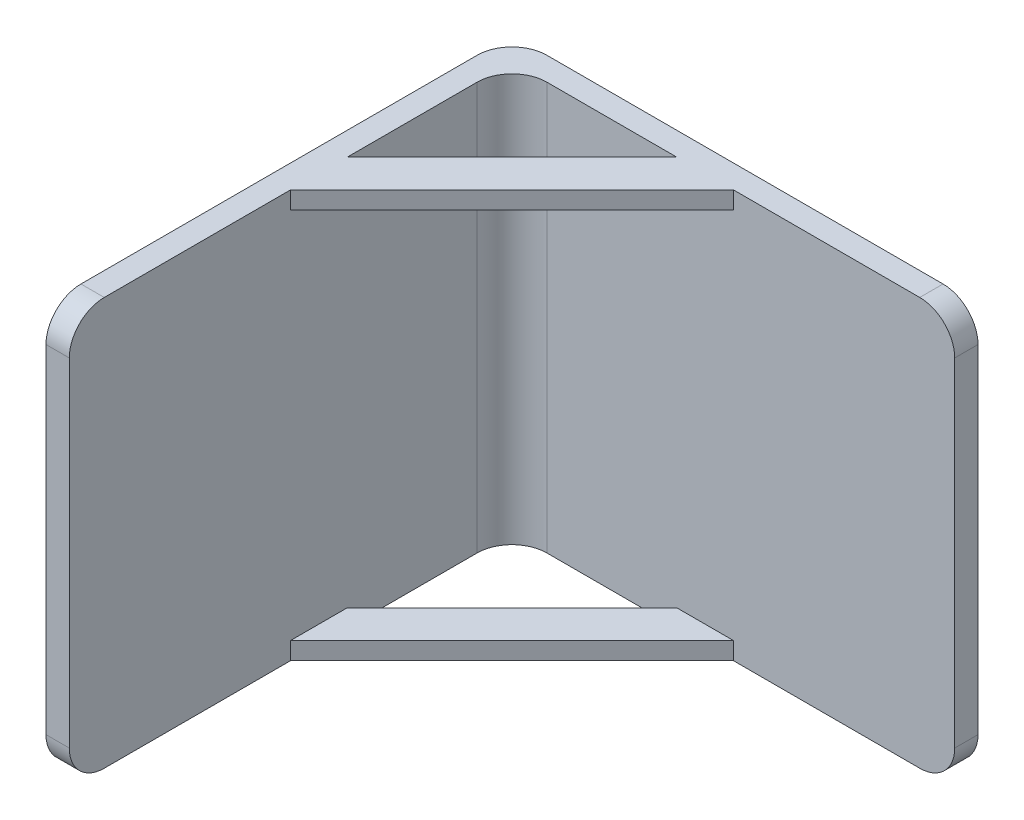
ISO-10303-21;
HEADER;
FILE_DESCRIPTION(('STEP AP214'),'2;1');
FILE_NAME('part.step','',(''),(''),'','','');
FILE_SCHEMA(('AUTOMOTIVE_DESIGN { 1 0 10303 214 1 1 1 1 }'));
ENDSEC;
DATA;
#1=APPLICATION_CONTEXT('core data for automotive mechanical design processes');
#2=APPLICATION_PROTOCOL_DEFINITION('international standard','automotive_design',2000,#1);
#3=PRODUCT_CONTEXT('',#1,'mechanical');
#4=PRODUCT('Part','Part','',(#3));
#5=PRODUCT_RELATED_PRODUCT_CATEGORY('part','',(#4));
#6=PRODUCT_DEFINITION_FORMATION('','',#4);
#7=PRODUCT_DEFINITION_CONTEXT('part definition',#1,'design');
#8=PRODUCT_DEFINITION('design','',#6,#7);
#9=PRODUCT_DEFINITION_SHAPE('','',#8);
#10=(LENGTH_UNIT() NAMED_UNIT(*) SI_UNIT(.MILLI.,.METRE.));
#11=(NAMED_UNIT(*) PLANE_ANGLE_UNIT() SI_UNIT($,.RADIAN.));
#12=(NAMED_UNIT(*) SI_UNIT($,.STERADIAN.) SOLID_ANGLE_UNIT());
#13=UNCERTAINTY_MEASURE_WITH_UNIT(LENGTH_MEASURE(1.E-05),#10,'distance_accuracy_value','');
#14=(GEOMETRIC_REPRESENTATION_CONTEXT(3) GLOBAL_UNCERTAINTY_ASSIGNED_CONTEXT((#13)) GLOBAL_UNIT_ASSIGNED_CONTEXT((#10,
#11,#12)) REPRESENTATION_CONTEXT('',''));
#15=CARTESIAN_POINT('',(0.,0.,0.));
#16=DIRECTION('',(0.,0.,1.));
#17=DIRECTION('',(1.,0.,0.));
#18=AXIS2_PLACEMENT_3D('',#15,#16,#17);
#19=CARTESIAN_POINT('',(0.,0.,2.));
#20=DIRECTION('',(0.,0.,-1.));
#21=DIRECTION('',(-1.,0.,0.));
#22=AXIS2_PLACEMENT_3D('',#19,#20,#21);
#23=PLANE('',#22);
#24=DIRECTION('',(1.,0.,0.));
#25=VECTOR('',#24,1.);
#26=CARTESIAN_POINT('',(-3.85786437626902,16.,2.));
#27=LINE('',#26,#25);
#28=CARTESIAN_POINT('',(-3.85786437626902,16.,2.));
#29=VERTEX_POINT('',#28);
#30=CARTESIAN_POINT('',(1.,16.,2.));
#31=VERTEX_POINT('',#30);
#32=EDGE_CURVE('E56',#29,#31,#27,.T.);
#33=ORIENTED_EDGE('',*,*,#32,.F.);
#34=DIRECTION('',(0.,-1.,0.));
#35=VECTOR('',#34,1.);
#36=CARTESIAN_POINT('',(-3.85786437626902,17.5,2.));
#37=LINE('',#36,#35);
#38=CARTESIAN_POINT('',(-3.85786437626902,17.5,2.));
#39=VERTEX_POINT('',#38);
#40=EDGE_CURVE('E182',#39,#29,#37,.T.);
#41=ORIENTED_EDGE('',*,*,#40,.F.);
#42=DIRECTION('',(-1.,0.,0.));
#43=VECTOR('',#42,1.);
#44=CARTESIAN_POINT('',(-20.,17.5,2.));
#45=LINE('',#44,#43);
#46=CARTESIAN_POINT('',(-15.,17.5,2.));
#47=VERTEX_POINT('',#46);
#48=EDGE_CURVE('E173',#39,#47,#45,.T.);
#49=ORIENTED_EDGE('',*,*,#48,.T.);
#50=DIRECTION('',(0.,1.,0.));
#51=VECTOR('',#50,1.);
#52=CARTESIAN_POINT('',(-15.,-17.5,2.));
#53=LINE('',#52,#51);
#54=CARTESIAN_POINT('',(-15.,-17.5,2.));
#55=VERTEX_POINT('',#54);
#56=EDGE_CURVE('E308',#47,#55,#53,.F.);
#57=ORIENTED_EDGE('',*,*,#56,.T.);
#58=DIRECTION('',(1.,0.,0.));
#59=VECTOR('',#58,1.);
#60=CARTESIAN_POINT('',(-20.,-17.5,2.));
#61=LINE('',#60,#59);
#62=CARTESIAN_POINT('',(-3.85786437626902,-17.5,2.));
#63=VERTEX_POINT('',#62);
#64=EDGE_CURVE('E255',#55,#63,#61,.T.);
#65=ORIENTED_EDGE('',*,*,#64,.T.);
#66=DIRECTION('',(0.,-1.,0.));
#67=VECTOR('',#66,1.);
#68=CARTESIAN_POINT('',(-3.85786437626902,-16.,2.));
#69=LINE('',#68,#67);
#70=CARTESIAN_POINT('',(-3.85786437626902,-16.,2.));
#71=VERTEX_POINT('',#70);
#72=EDGE_CURVE('E226',#71,#63,#69,.T.);
#73=ORIENTED_EDGE('',*,*,#72,.F.);
#74=DIRECTION('',(1.,0.,0.));
#75=VECTOR('',#74,1.);
#76=CARTESIAN_POINT('',(-3.85786437626902,-16.,2.));
#77=LINE('',#76,#75);
#78=CARTESIAN_POINT('',(1.,-16.,2.));
#79=VERTEX_POINT('',#78);
#80=EDGE_CURVE('E210',#71,#79,#77,.T.);
#81=ORIENTED_EDGE('',*,*,#80,.T.);
#82=DIRECTION('',(0.,-1.,0.));
#83=VECTOR('',#82,1.);
#84=CARTESIAN_POINT('',(1.,-16.,2.));
#85=LINE('',#84,#83);
#86=CARTESIAN_POINT('',(1.,-17.5,2.));
#87=VERTEX_POINT('',#86);
#88=EDGE_CURVE('E221',#79,#87,#85,.T.);
#89=ORIENTED_EDGE('',*,*,#88,.T.);
#90=CARTESIAN_POINT('',(17.,-17.5,2.));
#91=VERTEX_POINT('',#90);
#92=EDGE_CURVE('E254',#87,#91,#61,.T.);
#93=ORIENTED_EDGE('',*,*,#92,.T.);
#94=CARTESIAN_POINT('',(17.,-14.5,2.));
#95=DIRECTION('',(0.,0.,-1.));
#96=DIRECTION('',(-1.,0.,0.));
#97=AXIS2_PLACEMENT_3D('',#94,#95,#96);
#98=CIRCLE('',#97,3.);
#99=CARTESIAN_POINT('',(20.,-14.5,2.));
#100=VERTEX_POINT('',#99);
#101=EDGE_CURVE('E304',#91,#100,#98,.F.);
#102=ORIENTED_EDGE('',*,*,#101,.T.);
#103=DIRECTION('',(0.,1.,0.));
#104=VECTOR('',#103,1.);
#105=CARTESIAN_POINT('',(20.,-17.5,2.));
#106=LINE('',#105,#104);
#107=CARTESIAN_POINT('',(20.,14.5,2.));
#108=VERTEX_POINT('',#107);
#109=EDGE_CURVE('E180',#100,#108,#106,.T.);
#110=ORIENTED_EDGE('',*,*,#109,.T.);
#111=CARTESIAN_POINT('',(17.,14.5,2.));
#112=DIRECTION('',(0.,0.,-1.));
#113=DIRECTION('',(-1.,0.,0.));
#114=AXIS2_PLACEMENT_3D('',#111,#112,#113);
#115=CIRCLE('',#114,3.);
#116=CARTESIAN_POINT('',(17.,17.5,2.));
#117=VERTEX_POINT('',#116);
#118=EDGE_CURVE('E306',#108,#117,#115,.F.);
#119=ORIENTED_EDGE('',*,*,#118,.T.);
#120=CARTESIAN_POINT('',(1.,17.5,2.));
#121=VERTEX_POINT('',#120);
#122=EDGE_CURVE('E179',#117,#121,#45,.T.);
#123=ORIENTED_EDGE('',*,*,#122,.T.);
#124=DIRECTION('',(0.,-1.,0.));
#125=VECTOR('',#124,1.);
#126=CARTESIAN_POINT('',(1.,17.5,2.));
#127=LINE('',#126,#125);
#128=EDGE_CURVE('E51',#121,#31,#127,.T.);
#129=ORIENTED_EDGE('',*,*,#128,.T.);
#130=EDGE_LOOP('',(#33,#41,#49,#57,#65,#73,#81,#89,#93,#102,#110,#119,#123,#129));
#131=FACE_BOUND('',#130,.T.);
#132=ADVANCED_FACE('F36',(#131),#23,.F.);
#133=CARTESIAN_POINT('',(20.,-17.5,2.));
#134=DIRECTION('',(-1.,0.,0.));
#135=DIRECTION('',(0.,0.,1.));
#136=AXIS2_PLACEMENT_3D('',#133,#134,#135);
#137=PLANE('',#136);
#138=DIRECTION('',(0.,1.,0.));
#139=VECTOR('',#138,1.);
#140=CARTESIAN_POINT('',(20.,-17.5,0.));
#141=LINE('',#140,#139);
#142=CARTESIAN_POINT('',(20.,-14.5,0.));
#143=VERTEX_POINT('',#142);
#144=CARTESIAN_POINT('',(20.,14.5,0.));
#145=VERTEX_POINT('',#144);
#146=EDGE_CURVE('E250',#143,#145,#141,.T.);
#147=ORIENTED_EDGE('',*,*,#146,.T.);
#148=DIRECTION('',(0.,0.,-1.));
#149=VECTOR('',#148,1.);
#150=CARTESIAN_POINT('',(20.,14.5,2.));
#151=LINE('',#150,#149);
#152=EDGE_CURVE('E313',#145,#108,#151,.F.);
#153=ORIENTED_EDGE('',*,*,#152,.T.);
#154=ORIENTED_EDGE('',*,*,#109,.F.);
#155=DIRECTION('',(0.,0.,-1.));
#156=VECTOR('',#155,1.);
#157=CARTESIAN_POINT('',(20.,-14.5,2.));
#158=LINE('',#157,#156);
#159=EDGE_CURVE('E310',#100,#143,#158,.T.);
#160=ORIENTED_EDGE('',*,*,#159,.T.);
#161=EDGE_LOOP('',(#147,#153,#154,#160));
#162=FACE_BOUND('',#161,.T.);
#163=ADVANCED_FACE('F363',(#162),#137,.F.);
#164=CARTESIAN_POINT('',(-20.,17.5,2.));
#165=DIRECTION('',(0.,-1.,0.));
#166=DIRECTION('',(0.,0.,-1.));
#167=AXIS2_PLACEMENT_3D('',#164,#165,#166);
#168=PLANE('',#167);
#169=DIRECTION('',(-0.707106781186548,0.,0.707106781186548));
#170=VECTOR('',#169,1.);
#171=CARTESIAN_POINT('',(1.,17.5,2.));
#172=LINE('',#171,#170);
#173=CARTESIAN_POINT('',(-18.,17.5,21.));
#174=VERTEX_POINT('',#173);
#175=EDGE_CURVE('E191',#121,#174,#172,.T.);
#176=ORIENTED_EDGE('',*,*,#175,.F.);
#177=ORIENTED_EDGE('',*,*,#122,.F.);
#178=DIRECTION('',(0.,0.,-1.));
#179=VECTOR('',#178,1.);
#180=CARTESIAN_POINT('',(17.,17.5,2.));
#181=LINE('',#180,#179);
#182=CARTESIAN_POINT('',(17.,17.5,0.));
#183=VERTEX_POINT('',#182);
#184=EDGE_CURVE('E292',#117,#183,#181,.T.);
#185=ORIENTED_EDGE('',*,*,#184,.T.);
#186=DIRECTION('',(-1.,0.,0.));
#187=VECTOR('',#186,1.);
#188=CARTESIAN_POINT('',(-20.,17.5,0.));
#189=LINE('',#188,#187);
#190=CARTESIAN_POINT('',(-17.,17.5,0.));
#191=VERTEX_POINT('',#190);
#192=EDGE_CURVE('E260',#183,#191,#189,.T.);
#193=ORIENTED_EDGE('',*,*,#192,.T.);
#194=CARTESIAN_POINT('',(-17.,17.5,3.));
#195=DIRECTION('',(0.,-1.,0.));
#196=DIRECTION('',(0.,0.,-1.));
#197=AXIS2_PLACEMENT_3D('',#194,#195,#196);
#198=CIRCLE('',#197,3.);
#199=CARTESIAN_POINT('',(-20.,17.5,3.));
#200=VERTEX_POINT('',#199);
#201=EDGE_CURVE('E295',#191,#200,#198,.F.);
#202=ORIENTED_EDGE('',*,*,#201,.T.);
#203=DIRECTION('',(0.,0.,-1.));
#204=VECTOR('',#203,1.);
#205=CARTESIAN_POINT('',(-20.,17.5,2.));
#206=LINE('',#205,#204);
#207=CARTESIAN_POINT('',(-20.,17.5,37.));
#208=VERTEX_POINT('',#207);
#209=EDGE_CURVE('E267',#208,#200,#206,.T.);
#210=ORIENTED_EDGE('',*,*,#209,.F.);
#211=DIRECTION('',(-1.,0.,0.));
#212=VECTOR('',#211,1.);
#213=CARTESIAN_POINT('',(-20.,17.5,37.));
#214=LINE('',#213,#212);
#215=CARTESIAN_POINT('',(-18.,17.5,37.));
#216=VERTEX_POINT('',#215);
#217=EDGE_CURVE('E290',#208,#216,#214,.F.);
#218=ORIENTED_EDGE('',*,*,#217,.T.);
#219=DIRECTION('',(0.,0.,-1.));
#220=VECTOR('',#219,1.);
#221=CARTESIAN_POINT('',(-18.,17.5,40.));
#222=LINE('',#221,#220);
#223=EDGE_CURVE('E244',#216,#174,#222,.T.);
#224=ORIENTED_EDGE('',*,*,#223,.T.);
#225=EDGE_LOOP('',(#176,#177,#185,#193,#202,#210,#218,#224));
#226=FACE_BOUND('',#225,.T.);
#227=ORIENTED_EDGE('',*,*,#48,.F.);
#228=DIRECTION('',(0.707106781186549,0.,-0.707106781186546));
#229=VECTOR('',#228,1.);
#230=CARTESIAN_POINT('',(-18.,17.5,16.1421356237309));
#231=LINE('',#230,#229);
#232=CARTESIAN_POINT('',(-18.,17.5,16.1421356237309));
#233=VERTEX_POINT('',#232);
#234=EDGE_CURVE('E176',#233,#39,#231,.T.);
#235=ORIENTED_EDGE('',*,*,#234,.F.);
#236=CARTESIAN_POINT('',(-18.,17.5,5.));
#237=VERTEX_POINT('',#236);
#238=EDGE_CURVE('E243',#233,#237,#222,.T.);
#239=ORIENTED_EDGE('',*,*,#238,.T.);
#240=CARTESIAN_POINT('',(-15.,17.5,5.));
#241=DIRECTION('',(0.,-1.,0.));
#242=DIRECTION('',(0.,0.,-1.));
#243=AXIS2_PLACEMENT_3D('',#240,#241,#242);
#244=CIRCLE('',#243,3.);
#245=EDGE_CURVE('E44',#237,#47,#244,.T.);
#246=ORIENTED_EDGE('',*,*,#245,.T.);
#247=EDGE_LOOP('',(#227,#235,#239,#246));
#248=FACE_BOUND('',#247,.T.);
#249=ADVANCED_FACE('F174',(#226,#248),#168,.F.);
#250=CARTESIAN_POINT('',(-20.,-17.5,2.));
#251=DIRECTION('',(1.,0.,0.));
#252=DIRECTION('',(0.,0.,-1.));
#253=AXIS2_PLACEMENT_3D('',#250,#251,#252);
#254=PLANE('',#253);
#255=ORIENTED_EDGE('',*,*,#209,.T.);
#256=DIRECTION('',(0.,-1.,0.));
#257=VECTOR('',#256,1.);
#258=CARTESIAN_POINT('',(-20.,-17.5,3.));
#259=LINE('',#258,#257);
#260=CARTESIAN_POINT('',(-20.,-17.5,3.));
#261=VERTEX_POINT('',#260);
#262=EDGE_CURVE('E274',#200,#261,#259,.T.);
#263=ORIENTED_EDGE('',*,*,#262,.T.);
#264=DIRECTION('',(0.,0.,-1.));
#265=VECTOR('',#264,1.);
#266=CARTESIAN_POINT('',(-20.,-17.5,2.));
#267=LINE('',#266,#265);
#268=CARTESIAN_POINT('',(-20.,-17.5,37.));
#269=VERTEX_POINT('',#268);
#270=EDGE_CURVE('E257',#269,#261,#267,.T.);
#271=ORIENTED_EDGE('',*,*,#270,.F.);
#272=CARTESIAN_POINT('',(-20.,-14.5,37.));
#273=DIRECTION('',(1.,0.,0.));
#274=DIRECTION('',(0.,0.,-1.));
#275=AXIS2_PLACEMENT_3D('',#272,#273,#274);
#276=CIRCLE('',#275,3.);
#277=CARTESIAN_POINT('',(-20.,-14.5,40.));
#278=VERTEX_POINT('',#277);
#279=EDGE_CURVE('E270',#269,#278,#276,.F.);
#280=ORIENTED_EDGE('',*,*,#279,.T.);
#281=DIRECTION('',(0.,-1.,0.));
#282=VECTOR('',#281,1.);
#283=CARTESIAN_POINT('',(-20.,17.5,40.));
#284=LINE('',#283,#282);
#285=CARTESIAN_POINT('',(-20.,14.5,40.));
#286=VERTEX_POINT('',#285);
#287=EDGE_CURVE('E229',#286,#278,#284,.T.);
#288=ORIENTED_EDGE('',*,*,#287,.F.);
#289=CARTESIAN_POINT('',(-20.,14.5,37.));
#290=DIRECTION('',(1.,0.,0.));
#291=DIRECTION('',(0.,0.,-1.));
#292=AXIS2_PLACEMENT_3D('',#289,#290,#291);
#293=CIRCLE('',#292,3.);
#294=EDGE_CURVE('E272',#286,#208,#293,.F.);
#295=ORIENTED_EDGE('',*,*,#294,.T.);
#296=EDGE_LOOP('',(#255,#263,#271,#280,#288,#295));
#297=FACE_BOUND('',#296,.T.);
#298=ADVANCED_FACE('F329',(#297),#254,.F.);
#299=CARTESIAN_POINT('',(-20.,-17.5,2.));
#300=DIRECTION('',(0.,1.,0.));
#301=DIRECTION('',(0.,0.,1.));
#302=AXIS2_PLACEMENT_3D('',#299,#300,#301);
#303=PLANE('',#302);
#304=ORIENTED_EDGE('',*,*,#92,.F.);
#305=DIRECTION('',(-0.707106781186548,0.,0.707106781186548));
#306=VECTOR('',#305,1.);
#307=CARTESIAN_POINT('',(1.,-17.5,2.));
#308=LINE('',#307,#306);
#309=CARTESIAN_POINT('',(-18.,-17.5,21.));
#310=VERTEX_POINT('',#309);
#311=EDGE_CURVE('E186',#87,#310,#308,.T.);
#312=ORIENTED_EDGE('',*,*,#311,.T.);
#313=DIRECTION('',(0.,0.,-1.));
#314=VECTOR('',#313,1.);
#315=CARTESIAN_POINT('',(-18.,-17.5,40.));
#316=LINE('',#315,#314);
#317=CARTESIAN_POINT('',(-18.,-17.5,37.));
#318=VERTEX_POINT('',#317);
#319=EDGE_CURVE('E248',#318,#310,#316,.T.);
#320=ORIENTED_EDGE('',*,*,#319,.F.);
#321=DIRECTION('',(1.,0.,0.));
#322=VECTOR('',#321,1.);
#323=CARTESIAN_POINT('',(-20.,-17.5,37.));
#324=LINE('',#323,#322);
#325=EDGE_CURVE('E277',#318,#269,#324,.F.);
#326=ORIENTED_EDGE('',*,*,#325,.T.);
#327=ORIENTED_EDGE('',*,*,#270,.T.);
#328=CARTESIAN_POINT('',(-17.,-17.5,3.));
#329=DIRECTION('',(0.,1.,0.));
#330=DIRECTION('',(0.,0.,1.));
#331=AXIS2_PLACEMENT_3D('',#328,#329,#330);
#332=CIRCLE('',#331,3.);
#333=CARTESIAN_POINT('',(-17.,-17.5,0.));
#334=VERTEX_POINT('',#333);
#335=EDGE_CURVE('E282',#261,#334,#332,.F.);
#336=ORIENTED_EDGE('',*,*,#335,.T.);
#337=DIRECTION('',(1.,0.,0.));
#338=VECTOR('',#337,1.);
#339=CARTESIAN_POINT('',(-20.,-17.5,0.));
#340=LINE('',#339,#338);
#341=CARTESIAN_POINT('',(17.,-17.5,0.));
#342=VERTEX_POINT('',#341);
#343=EDGE_CURVE('E252',#334,#342,#340,.T.);
#344=ORIENTED_EDGE('',*,*,#343,.T.);
#345=DIRECTION('',(0.,0.,-1.));
#346=VECTOR('',#345,1.);
#347=CARTESIAN_POINT('',(17.,-17.5,2.));
#348=LINE('',#347,#346);
#349=EDGE_CURVE('E279',#342,#91,#348,.F.);
#350=ORIENTED_EDGE('',*,*,#349,.T.);
#351=EDGE_LOOP('',(#304,#312,#320,#326,#327,#336,#344,#350));
#352=FACE_BOUND('',#351,.T.);
#353=DIRECTION('',(0.707106781186549,0.,-0.707106781186546));
#354=VECTOR('',#353,1.);
#355=CARTESIAN_POINT('',(-18.,-17.5,16.1421356237309));
#356=LINE('',#355,#354);
#357=CARTESIAN_POINT('',(-18.,-17.5,16.1421356237309));
#358=VERTEX_POINT('',#357);
#359=EDGE_CURVE('E213',#358,#63,#356,.T.);
#360=ORIENTED_EDGE('',*,*,#359,.T.);
#361=ORIENTED_EDGE('',*,*,#64,.F.);
#362=CARTESIAN_POINT('',(-15.,-17.5,5.));
#363=DIRECTION('',(0.,1.,0.));
#364=DIRECTION('',(0.,0.,1.));
#365=AXIS2_PLACEMENT_3D('',#362,#363,#364);
#366=CIRCLE('',#365,3.);
#367=CARTESIAN_POINT('',(-18.,-17.5,5.));
#368=VERTEX_POINT('',#367);
#369=EDGE_CURVE('E11',#55,#368,#366,.T.);
#370=ORIENTED_EDGE('',*,*,#369,.T.);
#371=EDGE_CURVE('E247',#358,#368,#316,.T.);
#372=ORIENTED_EDGE('',*,*,#371,.F.);
#373=EDGE_LOOP('',(#360,#361,#370,#372));
#374=FACE_BOUND('',#373,.T.);
#375=ADVANCED_FACE('F350',(#352,#374),#303,.F.);
#376=CARTESIAN_POINT('',(0.,0.,0.));
#377=DIRECTION('',(0.,0.,-1.));
#378=DIRECTION('',(-1.,0.,0.));
#379=AXIS2_PLACEMENT_3D('',#376,#377,#378);
#380=PLANE('',#379);
#381=ORIENTED_EDGE('',*,*,#343,.F.);
#382=DIRECTION('',(0.,-1.,0.));
#383=VECTOR('',#382,1.);
#384=CARTESIAN_POINT('',(-17.,17.5,0.));
#385=LINE('',#384,#383);
#386=EDGE_CURVE('E288',#334,#191,#385,.F.);
#387=ORIENTED_EDGE('',*,*,#386,.T.);
#388=ORIENTED_EDGE('',*,*,#192,.F.);
#389=CARTESIAN_POINT('',(17.,14.5,0.));
#390=DIRECTION('',(0.,0.,-1.));
#391=DIRECTION('',(-1.,0.,0.));
#392=AXIS2_PLACEMENT_3D('',#389,#390,#391);
#393=CIRCLE('',#392,3.);
#394=EDGE_CURVE('E286',#183,#145,#393,.T.);
#395=ORIENTED_EDGE('',*,*,#394,.T.);
#396=ORIENTED_EDGE('',*,*,#146,.F.);
#397=CARTESIAN_POINT('',(17.,-14.5,0.));
#398=DIRECTION('',(0.,0.,-1.));
#399=DIRECTION('',(-1.,0.,0.));
#400=AXIS2_PLACEMENT_3D('',#397,#398,#399);
#401=CIRCLE('',#400,3.);
#402=EDGE_CURVE('E284',#143,#342,#401,.T.);
#403=ORIENTED_EDGE('',*,*,#402,.T.);
#404=EDGE_LOOP('',(#381,#387,#388,#395,#396,#403));
#405=FACE_BOUND('',#404,.T.);
#406=ADVANCED_FACE('F354',(#405),#380,.T.);
#407=CARTESIAN_POINT('',(-18.,17.5,40.));
#408=DIRECTION('',(-1.,0.,0.));
#409=DIRECTION('',(0.,-1.,0.));
#410=AXIS2_PLACEMENT_3D('',#407,#408,#409);
#411=PLANE('',#410);
#412=ORIENTED_EDGE('',*,*,#238,.F.);
#413=DIRECTION('',(0.,-1.,0.));
#414=VECTOR('',#413,1.);
#415=CARTESIAN_POINT('',(-18.,17.5,16.1421356237309));
#416=LINE('',#415,#414);
#417=CARTESIAN_POINT('',(-18.,16.,16.1421356237309));
#418=VERTEX_POINT('',#417);
#419=EDGE_CURVE('E187',#233,#418,#416,.T.);
#420=ORIENTED_EDGE('',*,*,#419,.T.);
#421=DIRECTION('',(0.,0.,-1.));
#422=VECTOR('',#421,1.);
#423=CARTESIAN_POINT('',(-18.,16.,21.));
#424=LINE('',#423,#422);
#425=CARTESIAN_POINT('',(-18.,16.,21.));
#426=VERTEX_POINT('',#425);
#427=EDGE_CURVE('E203',#426,#418,#424,.T.);
#428=ORIENTED_EDGE('',*,*,#427,.F.);
#429=DIRECTION('',(0.,-1.,0.));
#430=VECTOR('',#429,1.);
#431=CARTESIAN_POINT('',(-18.,17.5,21.));
#432=LINE('',#431,#430);
#433=EDGE_CURVE('E193',#174,#426,#432,.T.);
#434=ORIENTED_EDGE('',*,*,#433,.F.);
#435=ORIENTED_EDGE('',*,*,#223,.F.);
#436=CARTESIAN_POINT('',(-18.,14.5,37.));
#437=DIRECTION('',(-1.,0.,0.));
#438=DIRECTION('',(0.,-1.,0.));
#439=AXIS2_PLACEMENT_3D('',#436,#437,#438);
#440=CIRCLE('',#439,3.);
#441=CARTESIAN_POINT('',(-18.,14.5,40.));
#442=VERTEX_POINT('',#441);
#443=EDGE_CURVE('E299',#216,#442,#440,.F.);
#444=ORIENTED_EDGE('',*,*,#443,.T.);
#445=DIRECTION('',(0.,1.,0.));
#446=VECTOR('',#445,1.);
#447=CARTESIAN_POINT('',(-18.,17.5,40.));
#448=LINE('',#447,#446);
#449=CARTESIAN_POINT('',(-18.,-14.5,40.));
#450=VERTEX_POINT('',#449);
#451=EDGE_CURVE('E240',#450,#442,#448,.T.);
#452=ORIENTED_EDGE('',*,*,#451,.F.);
#453=CARTESIAN_POINT('',(-18.,-14.5,37.));
#454=DIRECTION('',(-1.,0.,0.));
#455=DIRECTION('',(0.,-1.,0.));
#456=AXIS2_PLACEMENT_3D('',#453,#454,#455);
#457=CIRCLE('',#456,3.);
#458=EDGE_CURVE('E297',#450,#318,#457,.F.);
#459=ORIENTED_EDGE('',*,*,#458,.T.);
#460=ORIENTED_EDGE('',*,*,#319,.T.);
#461=DIRECTION('',(0.,-1.,0.));
#462=VECTOR('',#461,1.);
#463=CARTESIAN_POINT('',(-18.,-16.,21.));
#464=LINE('',#463,#462);
#465=CARTESIAN_POINT('',(-18.,-16.,21.));
#466=VERTEX_POINT('',#465);
#467=EDGE_CURVE('E233',#466,#310,#464,.T.);
#468=ORIENTED_EDGE('',*,*,#467,.F.);
#469=DIRECTION('',(0.,0.,-1.));
#470=VECTOR('',#469,1.);
#471=CARTESIAN_POINT('',(-18.,-16.,21.));
#472=LINE('',#471,#470);
#473=CARTESIAN_POINT('',(-18.,-16.,16.1421356237309));
#474=VERTEX_POINT('',#473);
#475=EDGE_CURVE('E216',#466,#474,#472,.T.);
#476=ORIENTED_EDGE('',*,*,#475,.T.);
#477=DIRECTION('',(0.,-1.,0.));
#478=VECTOR('',#477,1.);
#479=CARTESIAN_POINT('',(-18.,-16.,16.1421356237309));
#480=LINE('',#479,#478);
#481=EDGE_CURVE('E230',#474,#358,#480,.T.);
#482=ORIENTED_EDGE('',*,*,#481,.T.);
#483=ORIENTED_EDGE('',*,*,#371,.T.);
#484=DIRECTION('',(0.,1.,0.));
#485=VECTOR('',#484,1.);
#486=CARTESIAN_POINT('',(-18.,17.5,5.));
#487=LINE('',#486,#485);
#488=EDGE_CURVE('E301',#368,#237,#487,.T.);
#489=ORIENTED_EDGE('',*,*,#488,.T.);
#490=EDGE_LOOP('',(#412,#420,#428,#434,#435,#444,#452,#459,#460,#468,#476,#482,#483,#489));
#491=FACE_BOUND('',#490,.T.);
#492=ADVANCED_FACE('F336',(#491),#411,.F.);
#493=CARTESIAN_POINT('',(0.,0.,40.));
#494=DIRECTION('',(0.,0.,-1.));
#495=DIRECTION('',(-1.,0.,0.));
#496=AXIS2_PLACEMENT_3D('',#493,#494,#495);
#497=PLANE('',#496);
#498=ORIENTED_EDGE('',*,*,#451,.T.);
#499=DIRECTION('',(-1.,0.,0.));
#500=VECTOR('',#499,1.);
#501=CARTESIAN_POINT('',(0.,14.5,40.));
#502=LINE('',#501,#500);
#503=EDGE_CURVE('E318',#442,#286,#502,.T.);
#504=ORIENTED_EDGE('',*,*,#503,.T.);
#505=ORIENTED_EDGE('',*,*,#287,.T.);
#506=DIRECTION('',(1.,0.,0.));
#507=VECTOR('',#506,1.);
#508=CARTESIAN_POINT('',(0.,-14.5,40.));
#509=LINE('',#508,#507);
#510=EDGE_CURVE('E315',#278,#450,#509,.T.);
#511=ORIENTED_EDGE('',*,*,#510,.T.);
#512=EDGE_LOOP('',(#498,#504,#505,#511));
#513=FACE_BOUND('',#512,.T.);
#514=ADVANCED_FACE('F323',(#513),#497,.F.);
#515=CARTESIAN_POINT('',(-17.,-17.5,3.));
#516=DIRECTION('',(0.,1.,0.));
#517=DIRECTION('',(0.,0.,1.));
#518=AXIS2_PLACEMENT_3D('',#515,#516,#517);
#519=CYLINDRICAL_SURFACE('',#518,3.);
#520=ORIENTED_EDGE('',*,*,#201,.F.);
#521=ORIENTED_EDGE('',*,*,#386,.F.);
#522=ORIENTED_EDGE('',*,*,#335,.F.);
#523=ORIENTED_EDGE('',*,*,#262,.F.);
#524=EDGE_LOOP('',(#520,#521,#522,#523));
#525=FACE_BOUND('',#524,.T.);
#526=ADVANCED_FACE('F346',(#525),#519,.T.);
#527=CARTESIAN_POINT('',(-15.,17.5,5.));
#528=DIRECTION('',(0.,-1.,0.));
#529=DIRECTION('',(1.,0.,0.));
#530=AXIS2_PLACEMENT_3D('',#527,#528,#529);
#531=CYLINDRICAL_SURFACE('',#530,3.);
#532=ORIENTED_EDGE('',*,*,#369,.F.);
#533=ORIENTED_EDGE('',*,*,#56,.F.);
#534=ORIENTED_EDGE('',*,*,#245,.F.);
#535=ORIENTED_EDGE('',*,*,#488,.F.);
#536=EDGE_LOOP('',(#532,#533,#534,#535));
#537=FACE_BOUND('',#536,.T.);
#538=ADVANCED_FACE('F377',(#537),#531,.F.);
#539=CARTESIAN_POINT('',(17.,14.5,2.));
#540=DIRECTION('',(0.,0.,-1.));
#541=DIRECTION('',(-1.,0.,0.));
#542=AXIS2_PLACEMENT_3D('',#539,#540,#541);
#543=CYLINDRICAL_SURFACE('',#542,3.);
#544=ORIENTED_EDGE('',*,*,#118,.F.);
#545=ORIENTED_EDGE('',*,*,#152,.F.);
#546=ORIENTED_EDGE('',*,*,#394,.F.);
#547=ORIENTED_EDGE('',*,*,#184,.F.);
#548=EDGE_LOOP('',(#544,#545,#546,#547));
#549=FACE_BOUND('',#548,.T.);
#550=ADVANCED_FACE('F369',(#549),#543,.T.);
#551=CARTESIAN_POINT('',(17.,-14.5,2.));
#552=DIRECTION('',(0.,0.,-1.));
#553=DIRECTION('',(-1.,0.,0.));
#554=AXIS2_PLACEMENT_3D('',#551,#552,#553);
#555=CYLINDRICAL_SURFACE('',#554,3.);
#556=ORIENTED_EDGE('',*,*,#101,.F.);
#557=ORIENTED_EDGE('',*,*,#349,.F.);
#558=ORIENTED_EDGE('',*,*,#402,.F.);
#559=ORIENTED_EDGE('',*,*,#159,.F.);
#560=EDGE_LOOP('',(#556,#557,#558,#559));
#561=FACE_BOUND('',#560,.T.);
#562=ADVANCED_FACE('F360',(#561),#555,.T.);
#563=CARTESIAN_POINT('',(0.,14.5,37.));
#564=DIRECTION('',(-1.,0.,0.));
#565=DIRECTION('',(0.,0.,1.));
#566=AXIS2_PLACEMENT_3D('',#563,#564,#565);
#567=CYLINDRICAL_SURFACE('',#566,3.);
#568=ORIENTED_EDGE('',*,*,#443,.F.);
#569=ORIENTED_EDGE('',*,*,#217,.F.);
#570=ORIENTED_EDGE('',*,*,#294,.F.);
#571=ORIENTED_EDGE('',*,*,#503,.F.);
#572=EDGE_LOOP('',(#568,#569,#570,#571));
#573=FACE_BOUND('',#572,.T.);
#574=ADVANCED_FACE('F340',(#573),#567,.T.);
#575=CARTESIAN_POINT('',(0.,-14.5,37.));
#576=DIRECTION('',(1.,0.,0.));
#577=DIRECTION('',(0.,0.,-1.));
#578=AXIS2_PLACEMENT_3D('',#575,#576,#577);
#579=CYLINDRICAL_SURFACE('',#578,3.);
#580=ORIENTED_EDGE('',*,*,#279,.F.);
#581=ORIENTED_EDGE('',*,*,#325,.F.);
#582=ORIENTED_EDGE('',*,*,#458,.F.);
#583=ORIENTED_EDGE('',*,*,#510,.F.);
#584=EDGE_LOOP('',(#580,#581,#582,#583));
#585=FACE_BOUND('',#584,.T.);
#586=ADVANCED_FACE('F38',(#585),#579,.T.);
#587=CARTESIAN_POINT('',(-18.,-16.,16.1421356237309));
#588=DIRECTION('',(-0.707106781186546,0.,-0.707106781186549));
#589=DIRECTION('',(-0.707106781186549,0.,0.707106781186546));
#590=AXIS2_PLACEMENT_3D('',#587,#588,#589);
#591=PLANE('',#590);
#592=ORIENTED_EDGE('',*,*,#359,.F.);
#593=ORIENTED_EDGE('',*,*,#481,.F.);
#594=DIRECTION('',(0.707106781186549,0.,-0.707106781186546));
#595=VECTOR('',#594,1.);
#596=CARTESIAN_POINT('',(-18.,-16.,16.1421356237309));
#597=LINE('',#596,#595);
#598=EDGE_CURVE('E218',#474,#71,#597,.T.);
#599=ORIENTED_EDGE('',*,*,#598,.T.);
#600=ORIENTED_EDGE('',*,*,#72,.T.);
#601=EDGE_LOOP('',(#592,#593,#599,#600));
#602=FACE_BOUND('',#601,.T.);
#603=ADVANCED_FACE('F382',(#602),#591,.T.);
#604=CARTESIAN_POINT('',(1.,-16.,2.));
#605=DIRECTION('',(0.707106781186547,0.,0.707106781186548));
#606=DIRECTION('',(0.707106781186548,0.,-0.707106781186547));
#607=AXIS2_PLACEMENT_3D('',#604,#605,#606);
#608=PLANE('',#607);
#609=ORIENTED_EDGE('',*,*,#311,.F.);
#610=ORIENTED_EDGE('',*,*,#88,.F.);
#611=DIRECTION('',(-0.707106781186548,0.,0.707106781186548));
#612=VECTOR('',#611,1.);
#613=CARTESIAN_POINT('',(1.,-16.,2.));
#614=LINE('',#613,#612);
#615=EDGE_CURVE('E212',#79,#466,#614,.T.);
#616=ORIENTED_EDGE('',*,*,#615,.T.);
#617=ORIENTED_EDGE('',*,*,#467,.T.);
#618=EDGE_LOOP('',(#609,#610,#616,#617));
#619=FACE_BOUND('',#618,.T.);
#620=ADVANCED_FACE('F392',(#619),#608,.T.);
#621=CARTESIAN_POINT('',(0.,-16.,0.));
#622=DIRECTION('',(0.,1.,0.));
#623=DIRECTION('',(0.,0.,1.));
#624=AXIS2_PLACEMENT_3D('',#621,#622,#623);
#625=PLANE('',#624);
#626=ORIENTED_EDGE('',*,*,#80,.F.);
#627=ORIENTED_EDGE('',*,*,#598,.F.);
#628=ORIENTED_EDGE('',*,*,#475,.F.);
#629=ORIENTED_EDGE('',*,*,#615,.F.);
#630=EDGE_LOOP('',(#626,#627,#628,#629));
#631=FACE_BOUND('',#630,.T.);
#632=ADVANCED_FACE('F388',(#631),#625,.T.);
#633=CARTESIAN_POINT('',(-18.,17.5,16.1421356237309));
#634=DIRECTION('',(-0.707106781186546,0.,-0.707106781186549));
#635=DIRECTION('',(-0.707106781186549,0.,0.707106781186546));
#636=AXIS2_PLACEMENT_3D('',#633,#634,#635);
#637=PLANE('',#636);
#638=DIRECTION('',(0.707106781186549,0.,-0.707106781186546));
#639=VECTOR('',#638,1.);
#640=CARTESIAN_POINT('',(-18.,16.,16.1421356237309));
#641=LINE('',#640,#639);
#642=EDGE_CURVE('E196',#418,#29,#641,.T.);
#643=ORIENTED_EDGE('',*,*,#642,.F.);
#644=ORIENTED_EDGE('',*,*,#419,.F.);
#645=ORIENTED_EDGE('',*,*,#234,.T.);
#646=ORIENTED_EDGE('',*,*,#40,.T.);
#647=EDGE_LOOP('',(#643,#644,#645,#646));
#648=FACE_BOUND('',#647,.T.);
#649=ADVANCED_FACE('F190',(#648),#637,.T.);
#650=CARTESIAN_POINT('',(1.,17.5,2.));
#651=DIRECTION('',(0.707106781186547,0.,0.707106781186548));
#652=DIRECTION('',(0.707106781186548,0.,-0.707106781186547));
#653=AXIS2_PLACEMENT_3D('',#650,#651,#652);
#654=PLANE('',#653);
#655=DIRECTION('',(-0.707106781186548,0.,0.707106781186548));
#656=VECTOR('',#655,1.);
#657=CARTESIAN_POINT('',(1.,16.,2.));
#658=LINE('',#657,#656);
#659=EDGE_CURVE('E200',#31,#426,#658,.T.);
#660=ORIENTED_EDGE('',*,*,#659,.F.);
#661=ORIENTED_EDGE('',*,*,#128,.F.);
#662=ORIENTED_EDGE('',*,*,#175,.T.);
#663=ORIENTED_EDGE('',*,*,#433,.T.);
#664=EDGE_LOOP('',(#660,#661,#662,#663));
#665=FACE_BOUND('',#664,.T.);
#666=ADVANCED_FACE('F371',(#665),#654,.T.);
#667=CARTESIAN_POINT('',(0.,16.,0.));
#668=DIRECTION('',(0.,1.,0.));
#669=DIRECTION('',(0.,0.,1.));
#670=AXIS2_PLACEMENT_3D('',#667,#668,#669);
#671=PLANE('',#670);
#672=ORIENTED_EDGE('',*,*,#32,.T.);
#673=ORIENTED_EDGE('',*,*,#659,.T.);
#674=ORIENTED_EDGE('',*,*,#427,.T.);
#675=ORIENTED_EDGE('',*,*,#642,.T.);
#676=EDGE_LOOP('',(#672,#673,#674,#675));
#677=FACE_BOUND('',#676,.T.);
#678=ADVANCED_FACE('F373',(#677),#671,.F.);
#679=CLOSED_SHELL('',(#132,#163,#249,#298,#375,#406,#492,#514,#526,#538,#550,#562,#574,#586,
#603,#620,#632,#649,#666,#678));
#680=MANIFOLD_SOLID_BREP('B2',#679);
#681=ADVANCED_BREP_SHAPE_REPRESENTATION('',(#18,#680),#14);
#682=SHAPE_DEFINITION_REPRESENTATION(#9,#681);
ENDSEC;
END-ISO-10303-21;
